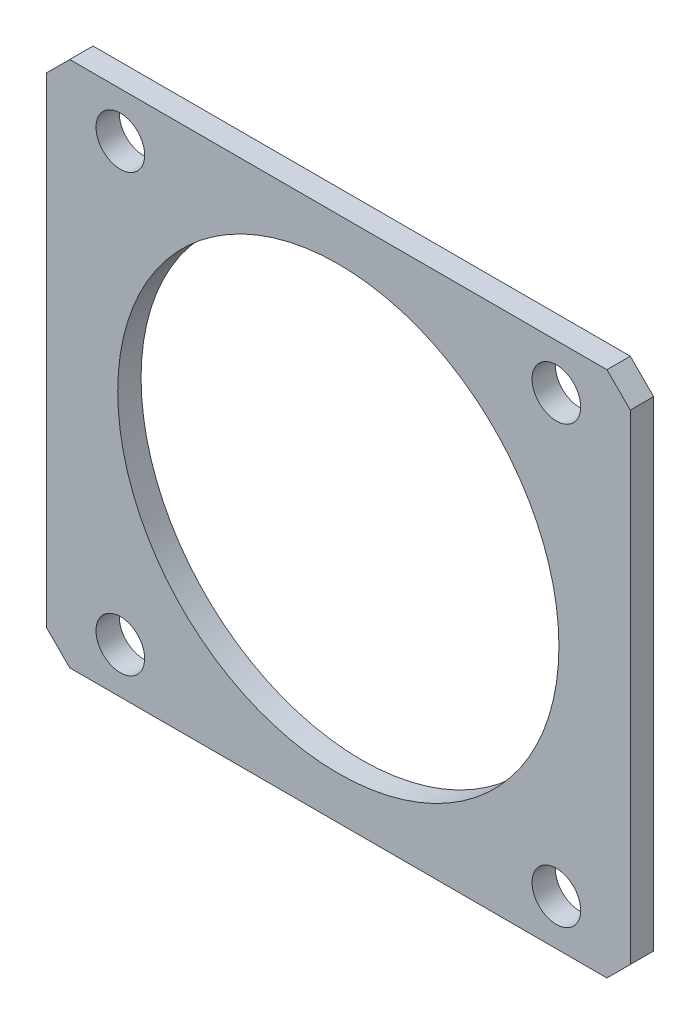
ISO-10303-21;
HEADER;
FILE_DESCRIPTION(('STEP AP214'),'2;1');
FILE_NAME('part.step','',(''),(''),'','','');
FILE_SCHEMA(('AUTOMOTIVE_DESIGN { 1 0 10303 214 1 1 1 1 }'));
ENDSEC;
DATA;
#1=APPLICATION_CONTEXT('core data for automotive mechanical design processes');
#2=APPLICATION_PROTOCOL_DEFINITION('international standard','automotive_design',2000,#1);
#3=PRODUCT_CONTEXT('',#1,'mechanical');
#4=PRODUCT('Part','Part','',(#3));
#5=PRODUCT_RELATED_PRODUCT_CATEGORY('part','',(#4));
#6=PRODUCT_DEFINITION_FORMATION('','',#4);
#7=PRODUCT_DEFINITION_CONTEXT('part definition',#1,'design');
#8=PRODUCT_DEFINITION('design','',#6,#7);
#9=PRODUCT_DEFINITION_SHAPE('','',#8);
#10=(LENGTH_UNIT() NAMED_UNIT(*) SI_UNIT(.MILLI.,.METRE.));
#11=(NAMED_UNIT(*) PLANE_ANGLE_UNIT() SI_UNIT($,.RADIAN.));
#12=(NAMED_UNIT(*) SI_UNIT($,.STERADIAN.) SOLID_ANGLE_UNIT());
#13=UNCERTAINTY_MEASURE_WITH_UNIT(LENGTH_MEASURE(1.E-05),#10,'distance_accuracy_value','');
#14=(GEOMETRIC_REPRESENTATION_CONTEXT(3) GLOBAL_UNCERTAINTY_ASSIGNED_CONTEXT((#13)) GLOBAL_UNIT_ASSIGNED_CONTEXT((#10,
#11,#12)) REPRESENTATION_CONTEXT('',''));
#15=CARTESIAN_POINT('',(0.,0.,0.));
#16=DIRECTION('',(0.,0.,1.));
#17=DIRECTION('',(1.,0.,0.));
#18=AXIS2_PLACEMENT_3D('',#15,#16,#17);
#19=CARTESIAN_POINT('',(-28.575,-25.781,2.286));
#20=DIRECTION('',(0.,0.,1.));
#21=DIRECTION('',(1.,0.,0.));
#22=AXIS2_PLACEMENT_3D('',#19,#20,#21);
#23=PLANE('',#22);
#24=CARTESIAN_POINT('',(21.336,21.336,2.286));
#25=DIRECTION('',(0.,0.,1.));
#26=DIRECTION('',(1.,0.,0.));
#27=AXIS2_PLACEMENT_3D('',#24,#25,#26);
#28=CIRCLE('',#27,2.38124999999999);
#29=CARTESIAN_POINT('',(23.71725,21.336,2.286));
#30=VERTEX_POINT('',#29);
#31=EDGE_CURVE('E205',#30,#30,#28,.T.);
#32=ORIENTED_EDGE('',*,*,#31,.F.);
#33=EDGE_LOOP('',(#32));
#34=FACE_BOUND('',#33,.T.);
#35=CARTESIAN_POINT('',(-21.336,21.336,2.286));
#36=DIRECTION('',(0.,0.,1.));
#37=DIRECTION('',(1.,0.,0.));
#38=AXIS2_PLACEMENT_3D('',#35,#36,#37);
#39=CIRCLE('',#38,2.38124999999999);
#40=CARTESIAN_POINT('',(-18.95475,21.336,2.286));
#41=VERTEX_POINT('',#40);
#42=EDGE_CURVE('E199',#41,#41,#39,.T.);
#43=ORIENTED_EDGE('',*,*,#42,.F.);
#44=EDGE_LOOP('',(#43));
#45=FACE_BOUND('',#44,.T.);
#46=CARTESIAN_POINT('',(-21.336,-21.336,2.286));
#47=DIRECTION('',(0.,0.,1.));
#48=DIRECTION('',(1.,0.,0.));
#49=AXIS2_PLACEMENT_3D('',#46,#47,#48);
#50=CIRCLE('',#49,2.38124999999999);
#51=CARTESIAN_POINT('',(-18.95475,-21.336,2.286));
#52=VERTEX_POINT('',#51);
#53=EDGE_CURVE('E193',#52,#52,#50,.T.);
#54=ORIENTED_EDGE('',*,*,#53,.F.);
#55=EDGE_LOOP('',(#54));
#56=FACE_BOUND('',#55,.T.);
#57=CARTESIAN_POINT('',(21.336,-21.336,2.286));
#58=DIRECTION('',(0.,0.,1.));
#59=DIRECTION('',(1.,0.,0.));
#60=AXIS2_PLACEMENT_3D('',#57,#58,#59);
#61=CIRCLE('',#60,2.38124999999999);
#62=CARTESIAN_POINT('',(23.71725,-21.336,2.286));
#63=VERTEX_POINT('',#62);
#64=EDGE_CURVE('E187',#63,#63,#61,.T.);
#65=ORIENTED_EDGE('',*,*,#64,.F.);
#66=EDGE_LOOP('',(#65));
#67=FACE_BOUND('',#66,.T.);
#68=DIRECTION('',(0.,1.,0.));
#69=VECTOR('',#68,1.);
#70=CARTESIAN_POINT('',(28.575,25.781,2.286));
#71=LINE('',#70,#69);
#72=CARTESIAN_POINT('',(28.575,-23.495,2.286));
#73=VERTEX_POINT('',#72);
#74=CARTESIAN_POINT('',(28.575,23.495,2.286));
#75=VERTEX_POINT('',#74);
#76=EDGE_CURVE('E175',#73,#75,#71,.T.);
#77=ORIENTED_EDGE('',*,*,#76,.T.);
#78=DIRECTION('',(0.707106781186546,-0.707106781186549,0.));
#79=VECTOR('',#78,1.);
#80=CARTESIAN_POINT('',(24.6380000000001,27.4319999999999,2.286));
#81=LINE('',#80,#79);
#82=CARTESIAN_POINT('',(26.289,25.781,2.286));
#83=VERTEX_POINT('',#82);
#84=EDGE_CURVE('E158',#75,#83,#81,.F.);
#85=ORIENTED_EDGE('',*,*,#84,.T.);
#86=DIRECTION('',(-1.,0.,0.));
#87=VECTOR('',#86,1.);
#88=CARTESIAN_POINT('',(-28.575,25.781,2.286));
#89=LINE('',#88,#87);
#90=CARTESIAN_POINT('',(-26.289,25.781,2.286));
#91=VERTEX_POINT('',#90);
#92=EDGE_CURVE('E129',#83,#91,#89,.T.);
#93=ORIENTED_EDGE('',*,*,#92,.T.);
#94=DIRECTION('',(0.707106781186549,0.707106781186546,0.));
#95=VECTOR('',#94,1.);
#96=CARTESIAN_POINT('',(-53.213,-1.14299999999993,2.286));
#97=LINE('',#96,#95);
#98=CARTESIAN_POINT('',(-28.575,23.495,2.286));
#99=VERTEX_POINT('',#98);
#100=EDGE_CURVE('E156',#91,#99,#97,.F.);
#101=ORIENTED_EDGE('',*,*,#100,.T.);
#102=DIRECTION('',(0.,-1.,0.));
#103=VECTOR('',#102,1.);
#104=CARTESIAN_POINT('',(-28.575,25.781,2.286));
#105=LINE('',#104,#103);
#106=CARTESIAN_POINT('',(-28.575,-23.495,2.286));
#107=VERTEX_POINT('',#106);
#108=EDGE_CURVE('E136',#99,#107,#105,.T.);
#109=ORIENTED_EDGE('',*,*,#108,.T.);
#110=DIRECTION('',(-0.707106781186546,0.707106781186549,0.));
#111=VECTOR('',#110,1.);
#112=CARTESIAN_POINT('',(-27.432,-24.638,2.286));
#113=LINE('',#112,#111);
#114=CARTESIAN_POINT('',(-26.289,-25.781,2.286));
#115=VERTEX_POINT('',#114);
#116=EDGE_CURVE('E64',#107,#115,#113,.F.);
#117=ORIENTED_EDGE('',*,*,#116,.T.);
#118=DIRECTION('',(1.,0.,0.));
#119=VECTOR('',#118,1.);
#120=CARTESIAN_POINT('',(-28.575,-25.781,2.286));
#121=LINE('',#120,#119);
#122=CARTESIAN_POINT('',(26.289,-25.781,2.286));
#123=VERTEX_POINT('',#122);
#124=EDGE_CURVE('E139',#115,#123,#121,.T.);
#125=ORIENTED_EDGE('',*,*,#124,.T.);
#126=DIRECTION('',(-0.707106781186549,-0.707106781186546,0.));
#127=VECTOR('',#126,1.);
#128=CARTESIAN_POINT('',(-1.1430000000001,-53.213,2.286));
#129=LINE('',#128,#127);
#130=EDGE_CURVE('E154',#123,#73,#129,.F.);
#131=ORIENTED_EDGE('',*,*,#130,.T.);
#132=EDGE_LOOP('',(#77,#85,#93,#101,#109,#117,#125,#131));
#133=FACE_BOUND('',#132,.T.);
#134=CARTESIAN_POINT('',(0.,0.,2.286));
#135=DIRECTION('',(0.,0.,1.));
#136=DIRECTION('',(1.,0.,0.));
#137=AXIS2_PLACEMENT_3D('',#134,#135,#136);
#138=CIRCLE('',#137,21.59);
#139=CARTESIAN_POINT('',(21.59,0.,2.286));
#140=VERTEX_POINT('',#139);
#141=EDGE_CURVE('E171',#140,#140,#138,.T.);
#142=ORIENTED_EDGE('',*,*,#141,.F.);
#143=EDGE_LOOP('',(#142));
#144=FACE_BOUND('',#143,.T.);
#145=ADVANCED_FACE('F44',(#34,#45,#56,#67,#133,#144),#23,.T.);
#146=CARTESIAN_POINT('',(-28.575,-25.781,0.));
#147=DIRECTION('',(0.,0.,1.));
#148=DIRECTION('',(1.,0.,0.));
#149=AXIS2_PLACEMENT_3D('',#146,#147,#148);
#150=PLANE('',#149);
#151=CARTESIAN_POINT('',(21.336,21.336,0.));
#152=DIRECTION('',(0.,0.,1.));
#153=DIRECTION('',(1.,0.,0.));
#154=AXIS2_PLACEMENT_3D('',#151,#152,#153);
#155=CIRCLE('',#154,2.38125);
#156=CARTESIAN_POINT('',(23.71725,21.336,0.));
#157=VERTEX_POINT('',#156);
#158=EDGE_CURVE('E202',#157,#157,#155,.T.);
#159=ORIENTED_EDGE('',*,*,#158,.T.);
#160=EDGE_LOOP('',(#159));
#161=FACE_BOUND('',#160,.T.);
#162=CARTESIAN_POINT('',(-21.336,21.336,0.));
#163=DIRECTION('',(0.,0.,1.));
#164=DIRECTION('',(1.,0.,0.));
#165=AXIS2_PLACEMENT_3D('',#162,#163,#164);
#166=CIRCLE('',#165,2.38125);
#167=CARTESIAN_POINT('',(-18.95475,21.336,0.));
#168=VERTEX_POINT('',#167);
#169=EDGE_CURVE('E196',#168,#168,#166,.T.);
#170=ORIENTED_EDGE('',*,*,#169,.T.);
#171=EDGE_LOOP('',(#170));
#172=FACE_BOUND('',#171,.T.);
#173=CARTESIAN_POINT('',(-21.336,-21.336,0.));
#174=DIRECTION('',(0.,0.,1.));
#175=DIRECTION('',(1.,0.,0.));
#176=AXIS2_PLACEMENT_3D('',#173,#174,#175);
#177=CIRCLE('',#176,2.38125);
#178=CARTESIAN_POINT('',(-18.95475,-21.336,0.));
#179=VERTEX_POINT('',#178);
#180=EDGE_CURVE('E190',#179,#179,#177,.T.);
#181=ORIENTED_EDGE('',*,*,#180,.T.);
#182=EDGE_LOOP('',(#181));
#183=FACE_BOUND('',#182,.T.);
#184=CARTESIAN_POINT('',(21.336,-21.336,0.));
#185=DIRECTION('',(0.,0.,1.));
#186=DIRECTION('',(1.,0.,0.));
#187=AXIS2_PLACEMENT_3D('',#184,#185,#186);
#188=CIRCLE('',#187,2.38125);
#189=CARTESIAN_POINT('',(23.71725,-21.336,0.));
#190=VERTEX_POINT('',#189);
#191=EDGE_CURVE('E182',#190,#190,#188,.T.);
#192=ORIENTED_EDGE('',*,*,#191,.T.);
#193=EDGE_LOOP('',(#192));
#194=FACE_BOUND('',#193,.T.);
#195=DIRECTION('',(-1.,0.,0.));
#196=VECTOR('',#195,1.);
#197=CARTESIAN_POINT('',(-28.575,25.781,0.));
#198=LINE('',#197,#196);
#199=CARTESIAN_POINT('',(26.289,25.781,0.));
#200=VERTEX_POINT('',#199);
#201=CARTESIAN_POINT('',(-26.289,25.781,0.));
#202=VERTEX_POINT('',#201);
#203=EDGE_CURVE('E126',#200,#202,#198,.T.);
#204=ORIENTED_EDGE('',*,*,#203,.F.);
#205=DIRECTION('',(-0.707106781186546,0.707106781186549,0.));
#206=VECTOR('',#205,1.);
#207=CARTESIAN_POINT('',(26.289,25.781,0.));
#208=LINE('',#207,#206);
#209=CARTESIAN_POINT('',(28.575,23.495,0.));
#210=VERTEX_POINT('',#209);
#211=EDGE_CURVE('E109',#200,#210,#208,.F.);
#212=ORIENTED_EDGE('',*,*,#211,.T.);
#213=DIRECTION('',(0.,1.,0.));
#214=VECTOR('',#213,1.);
#215=CARTESIAN_POINT('',(28.575,25.781,0.));
#216=LINE('',#215,#214);
#217=CARTESIAN_POINT('',(28.575,-23.495,0.));
#218=VERTEX_POINT('',#217);
#219=EDGE_CURVE('E137',#218,#210,#216,.T.);
#220=ORIENTED_EDGE('',*,*,#219,.F.);
#221=DIRECTION('',(0.707106781186549,0.707106781186546,0.));
#222=VECTOR('',#221,1.);
#223=CARTESIAN_POINT('',(28.575,-23.495,0.));
#224=LINE('',#223,#222);
#225=CARTESIAN_POINT('',(26.289,-25.781,0.));
#226=VERTEX_POINT('',#225);
#227=EDGE_CURVE('E147',#218,#226,#224,.F.);
#228=ORIENTED_EDGE('',*,*,#227,.T.);
#229=DIRECTION('',(1.,0.,0.));
#230=VECTOR('',#229,1.);
#231=CARTESIAN_POINT('',(-28.575,-25.781,0.));
#232=LINE('',#231,#230);
#233=CARTESIAN_POINT('',(-26.289,-25.781,0.));
#234=VERTEX_POINT('',#233);
#235=EDGE_CURVE('E141',#234,#226,#232,.T.);
#236=ORIENTED_EDGE('',*,*,#235,.F.);
#237=DIRECTION('',(0.707106781186546,-0.707106781186549,0.));
#238=VECTOR('',#237,1.);
#239=CARTESIAN_POINT('',(-26.289,-25.781,0.));
#240=LINE('',#239,#238);
#241=CARTESIAN_POINT('',(-28.575,-23.495,0.));
#242=VERTEX_POINT('',#241);
#243=EDGE_CURVE('E130',#234,#242,#240,.F.);
#244=ORIENTED_EDGE('',*,*,#243,.T.);
#245=DIRECTION('',(0.,-1.,0.));
#246=VECTOR('',#245,1.);
#247=CARTESIAN_POINT('',(-28.575,25.781,0.));
#248=LINE('',#247,#246);
#249=CARTESIAN_POINT('',(-28.575,23.495,0.));
#250=VERTEX_POINT('',#249);
#251=EDGE_CURVE('E170',#250,#242,#248,.T.);
#252=ORIENTED_EDGE('',*,*,#251,.F.);
#253=DIRECTION('',(-0.707106781186549,-0.707106781186546,0.));
#254=VECTOR('',#253,1.);
#255=CARTESIAN_POINT('',(-28.575,23.495,0.));
#256=LINE('',#255,#254);
#257=EDGE_CURVE('E120',#250,#202,#256,.F.);
#258=ORIENTED_EDGE('',*,*,#257,.T.);
#259=EDGE_LOOP('',(#204,#212,#220,#228,#236,#244,#252,#258));
#260=FACE_BOUND('',#259,.T.);
#261=CARTESIAN_POINT('',(0.,0.,0.));
#262=DIRECTION('',(0.,0.,1.));
#263=DIRECTION('',(1.,0.,0.));
#264=AXIS2_PLACEMENT_3D('',#261,#262,#263);
#265=CIRCLE('',#264,21.59);
#266=CARTESIAN_POINT('',(21.59,0.,0.));
#267=VERTEX_POINT('',#266);
#268=EDGE_CURVE('E179',#267,#267,#265,.T.);
#269=ORIENTED_EDGE('',*,*,#268,.T.);
#270=EDGE_LOOP('',(#269));
#271=FACE_BOUND('',#270,.T.);
#272=ADVANCED_FACE('F133',(#161,#172,#183,#194,#260,#271),#150,.F.);
#273=CARTESIAN_POINT('',(-28.575,25.781,2.286));
#274=DIRECTION('',(1.,0.,0.));
#275=DIRECTION('',(0.,0.,-1.));
#276=AXIS2_PLACEMENT_3D('',#273,#274,#275);
#277=PLANE('',#276);
#278=ORIENTED_EDGE('',*,*,#108,.F.);
#279=DIRECTION('',(0.,0.,-1.));
#280=VECTOR('',#279,1.);
#281=CARTESIAN_POINT('',(-28.575,23.495,2.286));
#282=LINE('',#281,#280);
#283=EDGE_CURVE('E162',#99,#250,#282,.T.);
#284=ORIENTED_EDGE('',*,*,#283,.T.);
#285=ORIENTED_EDGE('',*,*,#251,.T.);
#286=DIRECTION('',(0.,0.,1.));
#287=VECTOR('',#286,1.);
#288=CARTESIAN_POINT('',(-28.575,-23.495,2.286));
#289=LINE('',#288,#287);
#290=EDGE_CURVE('E160',#242,#107,#289,.T.);
#291=ORIENTED_EDGE('',*,*,#290,.T.);
#292=EDGE_LOOP('',(#278,#284,#285,#291));
#293=FACE_BOUND('',#292,.T.);
#294=ADVANCED_FACE('F230',(#293),#277,.F.);
#295=CARTESIAN_POINT('',(-28.575,-25.781,2.286));
#296=DIRECTION('',(0.,1.,0.));
#297=DIRECTION('',(0.,0.,1.));
#298=AXIS2_PLACEMENT_3D('',#295,#296,#297);
#299=PLANE('',#298);
#300=ORIENTED_EDGE('',*,*,#235,.T.);
#301=DIRECTION('',(0.,0.,1.));
#302=VECTOR('',#301,1.);
#303=CARTESIAN_POINT('',(26.289,-25.781,2.286));
#304=LINE('',#303,#302);
#305=EDGE_CURVE('E13',#226,#123,#304,.T.);
#306=ORIENTED_EDGE('',*,*,#305,.T.);
#307=ORIENTED_EDGE('',*,*,#124,.F.);
#308=DIRECTION('',(0.,0.,-1.));
#309=VECTOR('',#308,1.);
#310=CARTESIAN_POINT('',(-26.289,-25.781,2.286));
#311=LINE('',#310,#309);
#312=EDGE_CURVE('E52',#115,#234,#311,.T.);
#313=ORIENTED_EDGE('',*,*,#312,.T.);
#314=EDGE_LOOP('',(#300,#306,#307,#313));
#315=FACE_BOUND('',#314,.T.);
#316=ADVANCED_FACE('F167',(#315),#299,.F.);
#317=CARTESIAN_POINT('',(28.575,25.781,2.286));
#318=DIRECTION('',(-1.,0.,0.));
#319=DIRECTION('',(0.,0.,1.));
#320=AXIS2_PLACEMENT_3D('',#317,#318,#319);
#321=PLANE('',#320);
#322=ORIENTED_EDGE('',*,*,#219,.T.);
#323=DIRECTION('',(0.,0.,1.));
#324=VECTOR('',#323,1.);
#325=CARTESIAN_POINT('',(28.575,23.495,2.286));
#326=LINE('',#325,#324);
#327=EDGE_CURVE('E114',#210,#75,#326,.T.);
#328=ORIENTED_EDGE('',*,*,#327,.T.);
#329=ORIENTED_EDGE('',*,*,#76,.F.);
#330=DIRECTION('',(0.,0.,-1.));
#331=VECTOR('',#330,1.);
#332=CARTESIAN_POINT('',(28.575,-23.495,2.286));
#333=LINE('',#332,#331);
#334=EDGE_CURVE('E119',#73,#218,#333,.T.);
#335=ORIENTED_EDGE('',*,*,#334,.T.);
#336=EDGE_LOOP('',(#322,#328,#329,#335));
#337=FACE_BOUND('',#336,.T.);
#338=ADVANCED_FACE('F242',(#337),#321,.F.);
#339=CARTESIAN_POINT('',(-28.575,25.781,2.286));
#340=DIRECTION('',(0.,-1.,0.));
#341=DIRECTION('',(0.,0.,-1.));
#342=AXIS2_PLACEMENT_3D('',#339,#340,#341);
#343=PLANE('',#342);
#344=ORIENTED_EDGE('',*,*,#92,.F.);
#345=DIRECTION('',(0.,0.,-1.));
#346=VECTOR('',#345,1.);
#347=CARTESIAN_POINT('',(26.289,25.781,2.286));
#348=LINE('',#347,#346);
#349=EDGE_CURVE('E113',#83,#200,#348,.T.);
#350=ORIENTED_EDGE('',*,*,#349,.T.);
#351=ORIENTED_EDGE('',*,*,#203,.T.);
#352=DIRECTION('',(0.,0.,1.));
#353=VECTOR('',#352,1.);
#354=CARTESIAN_POINT('',(-26.289,25.781,2.286));
#355=LINE('',#354,#353);
#356=EDGE_CURVE('E131',#202,#91,#355,.T.);
#357=ORIENTED_EDGE('',*,*,#356,.T.);
#358=EDGE_LOOP('',(#344,#350,#351,#357));
#359=FACE_BOUND('',#358,.T.);
#360=ADVANCED_FACE('F125',(#359),#343,.F.);
#361=CARTESIAN_POINT('',(0.,0.,2.286));
#362=DIRECTION('',(0.,0.,-1.));
#363=DIRECTION('',(-1.,0.,0.));
#364=AXIS2_PLACEMENT_3D('',#361,#362,#363);
#365=CYLINDRICAL_SURFACE('',#364,21.59);
#366=ORIENTED_EDGE('',*,*,#141,.T.);
#367=EDGE_LOOP('',(#366));
#368=FACE_BOUND('',#367,.T.);
#369=ORIENTED_EDGE('',*,*,#268,.F.);
#370=EDGE_LOOP('',(#369));
#371=FACE_BOUND('',#370,.T.);
#372=ADVANCED_FACE('F223',(#368,#371),#365,.F.);
#373=CARTESIAN_POINT('',(21.336,-21.336,2.286));
#374=DIRECTION('',(0.,0.,1.));
#375=DIRECTION('',(1.,0.,0.));
#376=AXIS2_PLACEMENT_3D('',#373,#374,#375);
#377=CYLINDRICAL_SURFACE('',#376,2.38124999999999);
#378=ORIENTED_EDGE('',*,*,#191,.F.);
#379=EDGE_LOOP('',(#378));
#380=FACE_BOUND('',#379,.T.);
#381=ORIENTED_EDGE('',*,*,#64,.T.);
#382=EDGE_LOOP('',(#381));
#383=FACE_BOUND('',#382,.T.);
#384=ADVANCED_FACE('F226',(#380,#383),#377,.F.);
#385=CARTESIAN_POINT('',(-21.336,-21.336,2.286));
#386=DIRECTION('',(0.,0.,1.));
#387=DIRECTION('',(1.,0.,0.));
#388=AXIS2_PLACEMENT_3D('',#385,#386,#387);
#389=CYLINDRICAL_SURFACE('',#388,2.38124999999999);
#390=ORIENTED_EDGE('',*,*,#180,.F.);
#391=EDGE_LOOP('',(#390));
#392=FACE_BOUND('',#391,.T.);
#393=ORIENTED_EDGE('',*,*,#53,.T.);
#394=EDGE_LOOP('',(#393));
#395=FACE_BOUND('',#394,.T.);
#396=ADVANCED_FACE('F337',(#392,#395),#389,.F.);
#397=CARTESIAN_POINT('',(-21.336,21.336,2.286));
#398=DIRECTION('',(0.,0.,1.));
#399=DIRECTION('',(1.,0.,0.));
#400=AXIS2_PLACEMENT_3D('',#397,#398,#399);
#401=CYLINDRICAL_SURFACE('',#400,2.38124999999999);
#402=ORIENTED_EDGE('',*,*,#169,.F.);
#403=EDGE_LOOP('',(#402));
#404=FACE_BOUND('',#403,.T.);
#405=ORIENTED_EDGE('',*,*,#42,.T.);
#406=EDGE_LOOP('',(#405));
#407=FACE_BOUND('',#406,.T.);
#408=ADVANCED_FACE('F327',(#404,#407),#401,.F.);
#409=CARTESIAN_POINT('',(21.336,21.336,2.286));
#410=DIRECTION('',(0.,0.,1.));
#411=DIRECTION('',(1.,0.,0.));
#412=AXIS2_PLACEMENT_3D('',#409,#410,#411);
#413=CYLINDRICAL_SURFACE('',#412,2.38124999999999);
#414=ORIENTED_EDGE('',*,*,#158,.F.);
#415=EDGE_LOOP('',(#414));
#416=FACE_BOUND('',#415,.T.);
#417=ORIENTED_EDGE('',*,*,#31,.T.);
#418=EDGE_LOOP('',(#417));
#419=FACE_BOUND('',#418,.T.);
#420=ADVANCED_FACE('F209',(#416,#419),#413,.F.);
#421=CARTESIAN_POINT('',(26.289,25.781,2.286));
#422=DIRECTION('',(-0.707106781186549,-0.707106781186546,0.));
#423=DIRECTION('',(0.707106781186546,-0.707106781186549,0.));
#424=AXIS2_PLACEMENT_3D('',#421,#422,#423);
#425=PLANE('',#424);
#426=ORIENTED_EDGE('',*,*,#84,.F.);
#427=ORIENTED_EDGE('',*,*,#327,.F.);
#428=ORIENTED_EDGE('',*,*,#211,.F.);
#429=ORIENTED_EDGE('',*,*,#349,.F.);
#430=EDGE_LOOP('',(#426,#427,#428,#429));
#431=FACE_BOUND('',#430,.T.);
#432=ADVANCED_FACE('F112',(#431),#425,.F.);
#433=CARTESIAN_POINT('',(-28.575,23.495,2.286));
#434=DIRECTION('',(0.707106781186546,-0.707106781186549,0.));
#435=DIRECTION('',(0.707106781186549,0.707106781186546,0.));
#436=AXIS2_PLACEMENT_3D('',#433,#434,#435);
#437=PLANE('',#436);
#438=ORIENTED_EDGE('',*,*,#100,.F.);
#439=ORIENTED_EDGE('',*,*,#356,.F.);
#440=ORIENTED_EDGE('',*,*,#257,.F.);
#441=ORIENTED_EDGE('',*,*,#283,.F.);
#442=EDGE_LOOP('',(#438,#439,#440,#441));
#443=FACE_BOUND('',#442,.T.);
#444=ADVANCED_FACE('F250',(#443),#437,.F.);
#445=CARTESIAN_POINT('',(28.575,-23.495,2.286));
#446=DIRECTION('',(-0.707106781186546,0.707106781186549,0.));
#447=DIRECTION('',(-0.707106781186549,-0.707106781186546,0.));
#448=AXIS2_PLACEMENT_3D('',#445,#446,#447);
#449=PLANE('',#448);
#450=ORIENTED_EDGE('',*,*,#130,.F.);
#451=ORIENTED_EDGE('',*,*,#305,.F.);
#452=ORIENTED_EDGE('',*,*,#227,.F.);
#453=ORIENTED_EDGE('',*,*,#334,.F.);
#454=EDGE_LOOP('',(#450,#451,#452,#453));
#455=FACE_BOUND('',#454,.T.);
#456=ADVANCED_FACE('F252',(#455),#449,.F.);
#457=CARTESIAN_POINT('',(-26.289,-25.781,2.286));
#458=DIRECTION('',(0.707106781186549,0.707106781186546,0.));
#459=DIRECTION('',(-0.707106781186546,0.707106781186549,0.));
#460=AXIS2_PLACEMENT_3D('',#457,#458,#459);
#461=PLANE('',#460);
#462=ORIENTED_EDGE('',*,*,#116,.F.);
#463=ORIENTED_EDGE('',*,*,#290,.F.);
#464=ORIENTED_EDGE('',*,*,#243,.F.);
#465=ORIENTED_EDGE('',*,*,#312,.F.);
#466=EDGE_LOOP('',(#462,#463,#464,#465));
#467=FACE_BOUND('',#466,.T.);
#468=ADVANCED_FACE('F46',(#467),#461,.F.);
#469=CLOSED_SHELL('',(#145,#272,#294,#316,#338,#360,#372,#384,#396,#408,#420,#432,#444,#456,#468));
#470=MANIFOLD_SOLID_BREP('B2',#469);
#471=ADVANCED_BREP_SHAPE_REPRESENTATION('',(#18,#470),#14);
#472=SHAPE_DEFINITION_REPRESENTATION(#9,#471);
ENDSEC;
END-ISO-10303-21;
